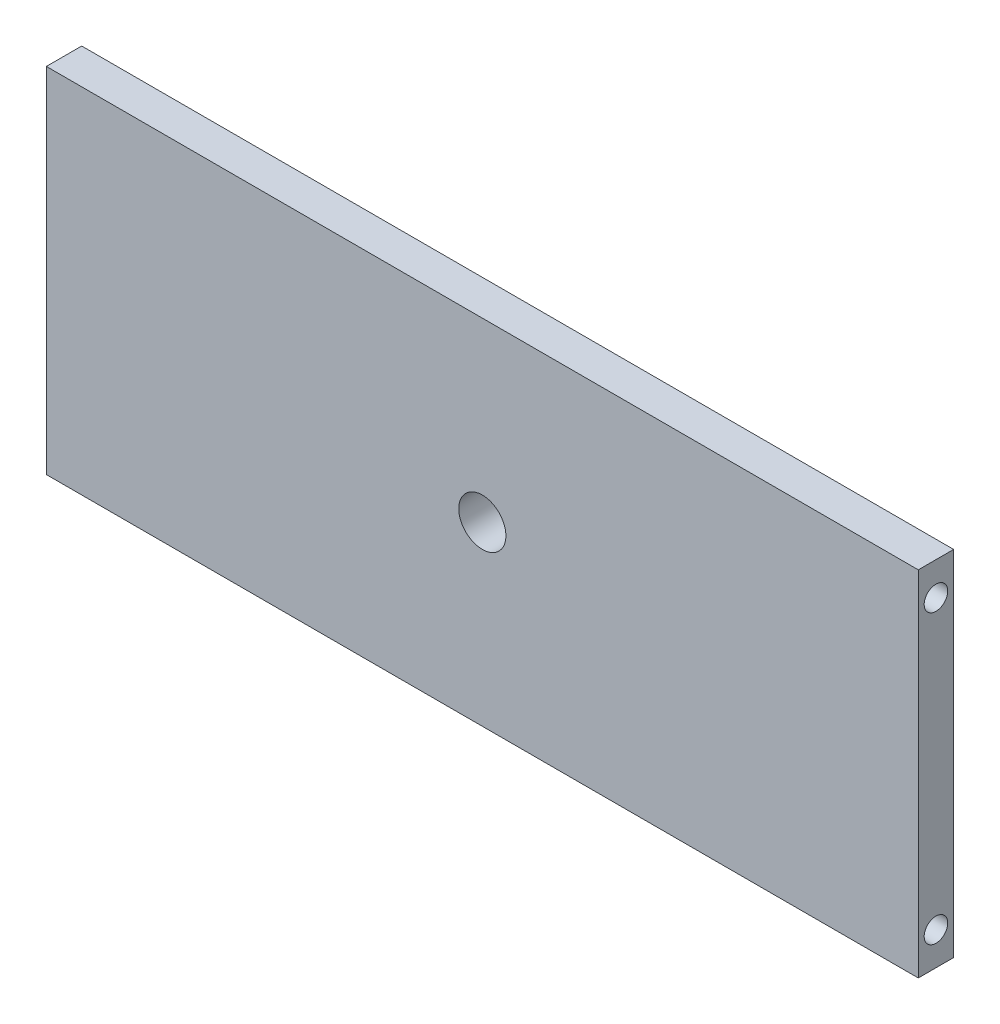
ISO-10303-21;
HEADER;
FILE_DESCRIPTION(('STEP AP214'),'2;1');
FILE_NAME('part.step','',(''),(''),'','','');
FILE_SCHEMA(('AUTOMOTIVE_DESIGN { 1 0 10303 214 1 1 1 1 }'));
ENDSEC;
DATA;
#1=APPLICATION_CONTEXT('core data for automotive mechanical design processes');
#2=APPLICATION_PROTOCOL_DEFINITION('international standard','automotive_design',2000,#1);
#3=PRODUCT_CONTEXT('',#1,'mechanical');
#4=PRODUCT('Part','Part','',(#3));
#5=PRODUCT_RELATED_PRODUCT_CATEGORY('part','',(#4));
#6=PRODUCT_DEFINITION_FORMATION('','',#4);
#7=PRODUCT_DEFINITION_CONTEXT('part definition',#1,'design');
#8=PRODUCT_DEFINITION('design','',#6,#7);
#9=PRODUCT_DEFINITION_SHAPE('','',#8);
#10=(LENGTH_UNIT() NAMED_UNIT(*) SI_UNIT(.MILLI.,.METRE.));
#11=(NAMED_UNIT(*) PLANE_ANGLE_UNIT() SI_UNIT($,.RADIAN.));
#12=(NAMED_UNIT(*) SI_UNIT($,.STERADIAN.) SOLID_ANGLE_UNIT());
#13=UNCERTAINTY_MEASURE_WITH_UNIT(LENGTH_MEASURE(1.E-05),#10,'distance_accuracy_value','');
#14=(GEOMETRIC_REPRESENTATION_CONTEXT(3) GLOBAL_UNCERTAINTY_ASSIGNED_CONTEXT((#13)) GLOBAL_UNIT_ASSIGNED_CONTEXT((#10,
#11,#12)) REPRESENTATION_CONTEXT('',''));
#15=CARTESIAN_POINT('',(0.,0.,0.));
#16=DIRECTION('',(0.,0.,1.));
#17=DIRECTION('',(1.,0.,0.));
#18=AXIS2_PLACEMENT_3D('',#15,#16,#17);
#19=CARTESIAN_POINT('',(185.,75.,15.));
#20=DIRECTION('',(-1.,0.,0.));
#21=DIRECTION('',(0.,0.,1.));
#22=AXIS2_PLACEMENT_3D('',#19,#20,#21);
#23=PLANE('',#22);
#24=CARTESIAN_POINT('',(185.,-61.0000000000001,7.49999999999998));
#25=DIRECTION('',(1.,0.,0.));
#26=DIRECTION('',(0.,1.,0.));
#27=AXIS2_PLACEMENT_3D('',#24,#25,#26);
#28=CIRCLE('',#27,5.);
#29=CARTESIAN_POINT('',(185.,-56.0000000000001,7.49999999999998));
#30=VERTEX_POINT('',#29);
#31=EDGE_CURVE('E127',#30,#30,#28,.T.);
#32=ORIENTED_EDGE('',*,*,#31,.F.);
#33=EDGE_LOOP('',(#32));
#34=FACE_BOUND('',#33,.T.);
#35=CARTESIAN_POINT('',(185.,60.9999999999999,7.5));
#36=DIRECTION('',(1.,0.,0.));
#37=DIRECTION('',(0.,1.,0.));
#38=AXIS2_PLACEMENT_3D('',#35,#36,#37);
#39=CIRCLE('',#38,5.00000000000001);
#40=CARTESIAN_POINT('',(185.,65.9999999999999,7.5));
#41=VERTEX_POINT('',#40);
#42=EDGE_CURVE('E121',#41,#41,#39,.T.);
#43=ORIENTED_EDGE('',*,*,#42,.F.);
#44=EDGE_LOOP('',(#43));
#45=FACE_BOUND('',#44,.T.);
#46=DIRECTION('',(0.,1.,0.));
#47=VECTOR('',#46,1.);
#48=CARTESIAN_POINT('',(185.,75.,0.));
#49=LINE('',#48,#47);
#50=CARTESIAN_POINT('',(185.,-75.,0.));
#51=VERTEX_POINT('',#50);
#52=CARTESIAN_POINT('',(185.,75.,0.));
#53=VERTEX_POINT('',#52);
#54=EDGE_CURVE('E95',#51,#53,#49,.T.);
#55=ORIENTED_EDGE('',*,*,#54,.T.);
#56=DIRECTION('',(0.,0.,-1.));
#57=VECTOR('',#56,1.);
#58=CARTESIAN_POINT('',(185.,75.,15.));
#59=LINE('',#58,#57);
#60=CARTESIAN_POINT('',(185.,75.,15.));
#61=VERTEX_POINT('',#60);
#62=EDGE_CURVE('E11',#61,#53,#59,.T.);
#63=ORIENTED_EDGE('',*,*,#62,.F.);
#64=DIRECTION('',(0.,1.,0.));
#65=VECTOR('',#64,1.);
#66=CARTESIAN_POINT('',(185.,75.,15.));
#67=LINE('',#66,#65);
#68=CARTESIAN_POINT('',(185.,-75.,15.));
#69=VERTEX_POINT('',#68);
#70=EDGE_CURVE('E83',#69,#61,#67,.T.);
#71=ORIENTED_EDGE('',*,*,#70,.F.);
#72=DIRECTION('',(0.,0.,-1.));
#73=VECTOR('',#72,1.);
#74=CARTESIAN_POINT('',(185.,-75.,15.));
#75=LINE('',#74,#73);
#76=EDGE_CURVE('E91',#69,#51,#75,.T.);
#77=ORIENTED_EDGE('',*,*,#76,.T.);
#78=EDGE_LOOP('',(#55,#63,#71,#77));
#79=FACE_BOUND('',#78,.T.);
#80=ADVANCED_FACE('F32',(#34,#45,#79),#23,.F.);
#81=CARTESIAN_POINT('',(-185.,75.,15.));
#82=DIRECTION('',(0.,-1.,0.));
#83=DIRECTION('',(0.,0.,-1.));
#84=AXIS2_PLACEMENT_3D('',#81,#82,#83);
#85=PLANE('',#84);
#86=DIRECTION('',(-1.,0.,0.));
#87=VECTOR('',#86,1.);
#88=CARTESIAN_POINT('',(-185.,75.,0.));
#89=LINE('',#88,#87);
#90=CARTESIAN_POINT('',(-185.,75.,0.));
#91=VERTEX_POINT('',#90);
#92=EDGE_CURVE('E87',#53,#91,#89,.T.);
#93=ORIENTED_EDGE('',*,*,#92,.T.);
#94=DIRECTION('',(0.,0.,-1.));
#95=VECTOR('',#94,1.);
#96=CARTESIAN_POINT('',(-185.,75.,15.));
#97=LINE('',#96,#95);
#98=CARTESIAN_POINT('',(-185.,75.,15.));
#99=VERTEX_POINT('',#98);
#100=EDGE_CURVE('E40',#99,#91,#97,.T.);
#101=ORIENTED_EDGE('',*,*,#100,.F.);
#102=DIRECTION('',(-1.,0.,0.));
#103=VECTOR('',#102,1.);
#104=CARTESIAN_POINT('',(-185.,75.,15.));
#105=LINE('',#104,#103);
#106=EDGE_CURVE('E78',#61,#99,#105,.T.);
#107=ORIENTED_EDGE('',*,*,#106,.F.);
#108=ORIENTED_EDGE('',*,*,#62,.T.);
#109=EDGE_LOOP('',(#93,#101,#107,#108));
#110=FACE_BOUND('',#109,.T.);
#111=ADVANCED_FACE('F86',(#110),#85,.F.);
#112=CARTESIAN_POINT('',(-185.,75.,15.));
#113=DIRECTION('',(1.,0.,0.));
#114=DIRECTION('',(0.,1.,0.));
#115=AXIS2_PLACEMENT_3D('',#112,#113,#114);
#116=PLANE('',#115);
#117=CARTESIAN_POINT('',(-185.,-61.,7.50000000000002));
#118=DIRECTION('',(-1.,0.,0.));
#119=DIRECTION('',(0.,-1.,0.));
#120=AXIS2_PLACEMENT_3D('',#117,#118,#119);
#121=CIRCLE('',#120,5.);
#122=CARTESIAN_POINT('',(-185.,-66.,7.50000000000002));
#123=VERTEX_POINT('',#122);
#124=EDGE_CURVE('E115',#123,#123,#121,.T.);
#125=ORIENTED_EDGE('',*,*,#124,.F.);
#126=EDGE_LOOP('',(#125));
#127=FACE_BOUND('',#126,.T.);
#128=CARTESIAN_POINT('',(-185.,61.,7.5));
#129=DIRECTION('',(-1.,0.,0.));
#130=DIRECTION('',(0.,-1.,0.));
#131=AXIS2_PLACEMENT_3D('',#128,#129,#130);
#132=CIRCLE('',#131,4.99999999999999);
#133=CARTESIAN_POINT('',(-185.,56.,7.5));
#134=VERTEX_POINT('',#133);
#135=EDGE_CURVE('E109',#134,#134,#132,.T.);
#136=ORIENTED_EDGE('',*,*,#135,.F.);
#137=EDGE_LOOP('',(#136));
#138=FACE_BOUND('',#137,.T.);
#139=DIRECTION('',(0.,-1.,0.));
#140=VECTOR('',#139,1.);
#141=CARTESIAN_POINT('',(-185.,75.,0.));
#142=LINE('',#141,#140);
#143=CARTESIAN_POINT('',(-185.,-75.,0.));
#144=VERTEX_POINT('',#143);
#145=EDGE_CURVE('E65',#91,#144,#142,.T.);
#146=ORIENTED_EDGE('',*,*,#145,.T.);
#147=DIRECTION('',(0.,0.,-1.));
#148=VECTOR('',#147,1.);
#149=CARTESIAN_POINT('',(-185.,-75.,15.));
#150=LINE('',#149,#148);
#151=CARTESIAN_POINT('',(-185.,-75.,15.));
#152=VERTEX_POINT('',#151);
#153=EDGE_CURVE('E88',#152,#144,#150,.T.);
#154=ORIENTED_EDGE('',*,*,#153,.F.);
#155=DIRECTION('',(0.,-1.,0.));
#156=VECTOR('',#155,1.);
#157=CARTESIAN_POINT('',(-185.,75.,15.));
#158=LINE('',#157,#156);
#159=EDGE_CURVE('E81',#99,#152,#158,.T.);
#160=ORIENTED_EDGE('',*,*,#159,.F.);
#161=ORIENTED_EDGE('',*,*,#100,.T.);
#162=EDGE_LOOP('',(#146,#154,#160,#161));
#163=FACE_BOUND('',#162,.T.);
#164=ADVANCED_FACE('F89',(#127,#138,#163),#116,.F.);
#165=CARTESIAN_POINT('',(-185.,-75.,15.));
#166=DIRECTION('',(0.,1.,0.));
#167=DIRECTION('',(0.,0.,1.));
#168=AXIS2_PLACEMENT_3D('',#165,#166,#167);
#169=PLANE('',#168);
#170=DIRECTION('',(1.,0.,0.));
#171=VECTOR('',#170,1.);
#172=CARTESIAN_POINT('',(-185.,-75.,0.));
#173=LINE('',#172,#171);
#174=EDGE_CURVE('E71',#144,#51,#173,.T.);
#175=ORIENTED_EDGE('',*,*,#174,.T.);
#176=ORIENTED_EDGE('',*,*,#76,.F.);
#177=DIRECTION('',(1.,0.,0.));
#178=VECTOR('',#177,1.);
#179=CARTESIAN_POINT('',(-185.,-75.,15.));
#180=LINE('',#179,#178);
#181=EDGE_CURVE('E48',#152,#69,#180,.T.);
#182=ORIENTED_EDGE('',*,*,#181,.F.);
#183=ORIENTED_EDGE('',*,*,#153,.T.);
#184=EDGE_LOOP('',(#175,#176,#182,#183));
#185=FACE_BOUND('',#184,.T.);
#186=ADVANCED_FACE('F103',(#185),#169,.F.);
#187=CARTESIAN_POINT('',(0.,0.,15.));
#188=DIRECTION('',(0.,0.,1.));
#189=DIRECTION('',(1.,0.,0.));
#190=AXIS2_PLACEMENT_3D('',#187,#188,#189);
#191=PLANE('',#190);
#192=CARTESIAN_POINT('',(0.,0.,15.));
#193=DIRECTION('',(0.,0.,1.));
#194=DIRECTION('',(1.,0.,0.));
#195=AXIS2_PLACEMENT_3D('',#192,#193,#194);
#196=CIRCLE('',#195,10.);
#197=CARTESIAN_POINT('',(10.,0.,15.));
#198=VERTEX_POINT('',#197);
#199=EDGE_CURVE('E133',#198,#198,#196,.T.);
#200=ORIENTED_EDGE('',*,*,#199,.F.);
#201=EDGE_LOOP('',(#200));
#202=FACE_BOUND('',#201,.T.);
#203=ORIENTED_EDGE('',*,*,#70,.T.);
#204=ORIENTED_EDGE('',*,*,#106,.T.);
#205=ORIENTED_EDGE('',*,*,#159,.T.);
#206=ORIENTED_EDGE('',*,*,#181,.T.);
#207=EDGE_LOOP('',(#203,#204,#205,#206));
#208=FACE_BOUND('',#207,.T.);
#209=ADVANCED_FACE('F79',(#202,#208),#191,.T.);
#210=CARTESIAN_POINT('',(0.,0.,0.));
#211=DIRECTION('',(0.,0.,1.));
#212=DIRECTION('',(1.,0.,0.));
#213=AXIS2_PLACEMENT_3D('',#210,#211,#212);
#214=PLANE('',#213);
#215=CARTESIAN_POINT('',(0.,0.,0.));
#216=DIRECTION('',(0.,0.,1.));
#217=DIRECTION('',(1.,0.,0.));
#218=AXIS2_PLACEMENT_3D('',#215,#216,#217);
#219=CIRCLE('',#218,10.);
#220=CARTESIAN_POINT('',(10.,0.,0.));
#221=VERTEX_POINT('',#220);
#222=EDGE_CURVE('E130',#221,#221,#219,.T.);
#223=ORIENTED_EDGE('',*,*,#222,.T.);
#224=EDGE_LOOP('',(#223));
#225=FACE_BOUND('',#224,.T.);
#226=ORIENTED_EDGE('',*,*,#54,.F.);
#227=ORIENTED_EDGE('',*,*,#174,.F.);
#228=ORIENTED_EDGE('',*,*,#145,.F.);
#229=ORIENTED_EDGE('',*,*,#92,.F.);
#230=EDGE_LOOP('',(#226,#227,#228,#229));
#231=FACE_BOUND('',#230,.T.);
#232=ADVANCED_FACE('F106',(#225,#231),#214,.F.);
#233=CARTESIAN_POINT('',(-155.,61.,7.5));
#234=DIRECTION('',(-1.,0.,0.));
#235=DIRECTION('',(0.,-1.,0.));
#236=AXIS2_PLACEMENT_3D('',#233,#234,#235);
#237=CYLINDRICAL_SURFACE('',#236,4.99999999999999);
#238=CARTESIAN_POINT('',(-155.,61.,7.5));
#239=DIRECTION('',(-1.,0.,0.));
#240=DIRECTION('',(0.,-1.,0.));
#241=AXIS2_PLACEMENT_3D('',#238,#239,#240);
#242=CIRCLE('',#241,4.99999999999999);
#243=CARTESIAN_POINT('',(-155.,56.,7.5));
#244=VERTEX_POINT('',#243);
#245=EDGE_CURVE('E98',#244,#244,#242,.T.);
#246=ORIENTED_EDGE('',*,*,#245,.F.);
#247=EDGE_LOOP('',(#246));
#248=FACE_BOUND('',#247,.T.);
#249=ORIENTED_EDGE('',*,*,#135,.T.);
#250=EDGE_LOOP('',(#249));
#251=FACE_BOUND('',#250,.T.);
#252=ADVANCED_FACE('F153',(#248,#251),#237,.F.);
#253=CARTESIAN_POINT('',(-155.,61.,7.5));
#254=DIRECTION('',(-1.,0.,0.));
#255=DIRECTION('',(0.,-1.,0.));
#256=AXIS2_PLACEMENT_3D('',#253,#254,#255);
#257=PLANE('',#256);
#258=ORIENTED_EDGE('',*,*,#245,.T.);
#259=EDGE_LOOP('',(#258));
#260=FACE_BOUND('',#259,.T.);
#261=ADVANCED_FACE('F187',(#260),#257,.T.);
#262=CARTESIAN_POINT('',(-155.,-61.,7.50000000000002));
#263=DIRECTION('',(-1.,0.,0.));
#264=DIRECTION('',(0.,-1.,0.));
#265=AXIS2_PLACEMENT_3D('',#262,#263,#264);
#266=CYLINDRICAL_SURFACE('',#265,5.);
#267=CARTESIAN_POINT('',(-155.,-61.,7.50000000000002));
#268=DIRECTION('',(-1.,0.,0.));
#269=DIRECTION('',(0.,-1.,0.));
#270=AXIS2_PLACEMENT_3D('',#267,#268,#269);
#271=CIRCLE('',#270,5.);
#272=CARTESIAN_POINT('',(-155.,-66.,7.50000000000002));
#273=VERTEX_POINT('',#272);
#274=EDGE_CURVE('E112',#273,#273,#271,.T.);
#275=ORIENTED_EDGE('',*,*,#274,.F.);
#276=EDGE_LOOP('',(#275));
#277=FACE_BOUND('',#276,.T.);
#278=ORIENTED_EDGE('',*,*,#124,.T.);
#279=EDGE_LOOP('',(#278));
#280=FACE_BOUND('',#279,.T.);
#281=ADVANCED_FACE('F179',(#277,#280),#266,.F.);
#282=CARTESIAN_POINT('',(-155.,-61.,7.50000000000002));
#283=DIRECTION('',(-1.,0.,0.));
#284=DIRECTION('',(0.,-1.,0.));
#285=AXIS2_PLACEMENT_3D('',#282,#283,#284);
#286=PLANE('',#285);
#287=ORIENTED_EDGE('',*,*,#274,.T.);
#288=EDGE_LOOP('',(#287));
#289=FACE_BOUND('',#288,.T.);
#290=ADVANCED_FACE('F169',(#289),#286,.T.);
#291=CARTESIAN_POINT('',(155.,60.9999999999999,7.5));
#292=DIRECTION('',(1.,0.,0.));
#293=DIRECTION('',(0.,1.,0.));
#294=AXIS2_PLACEMENT_3D('',#291,#292,#293);
#295=CYLINDRICAL_SURFACE('',#294,5.00000000000001);
#296=CARTESIAN_POINT('',(155.,60.9999999999999,7.5));
#297=DIRECTION('',(1.,0.,0.));
#298=DIRECTION('',(0.,1.,0.));
#299=AXIS2_PLACEMENT_3D('',#296,#297,#298);
#300=CIRCLE('',#299,5.00000000000001);
#301=CARTESIAN_POINT('',(155.,65.9999999999999,7.5));
#302=VERTEX_POINT('',#301);
#303=EDGE_CURVE('E118',#302,#302,#300,.T.);
#304=ORIENTED_EDGE('',*,*,#303,.F.);
#305=EDGE_LOOP('',(#304));
#306=FACE_BOUND('',#305,.T.);
#307=ORIENTED_EDGE('',*,*,#42,.T.);
#308=EDGE_LOOP('',(#307));
#309=FACE_BOUND('',#308,.T.);
#310=ADVANCED_FACE('F166',(#306,#309),#295,.F.);
#311=CARTESIAN_POINT('',(155.,60.9999999999999,7.5));
#312=DIRECTION('',(1.,0.,0.));
#313=DIRECTION('',(0.,1.,0.));
#314=AXIS2_PLACEMENT_3D('',#311,#312,#313);
#315=PLANE('',#314);
#316=ORIENTED_EDGE('',*,*,#303,.T.);
#317=EDGE_LOOP('',(#316));
#318=FACE_BOUND('',#317,.T.);
#319=ADVANCED_FACE('F168',(#318),#315,.T.);
#320=CARTESIAN_POINT('',(155.,-61.0000000000001,7.49999999999998));
#321=DIRECTION('',(1.,0.,0.));
#322=DIRECTION('',(0.,1.,0.));
#323=AXIS2_PLACEMENT_3D('',#320,#321,#322);
#324=CYLINDRICAL_SURFACE('',#323,5.);
#325=CARTESIAN_POINT('',(155.,-61.0000000000001,7.49999999999998));
#326=DIRECTION('',(1.,0.,0.));
#327=DIRECTION('',(0.,1.,0.));
#328=AXIS2_PLACEMENT_3D('',#325,#326,#327);
#329=CIRCLE('',#328,5.);
#330=CARTESIAN_POINT('',(155.,-56.0000000000001,7.49999999999998));
#331=VERTEX_POINT('',#330);
#332=EDGE_CURVE('E124',#331,#331,#329,.T.);
#333=ORIENTED_EDGE('',*,*,#332,.F.);
#334=EDGE_LOOP('',(#333));
#335=FACE_BOUND('',#334,.T.);
#336=ORIENTED_EDGE('',*,*,#31,.T.);
#337=EDGE_LOOP('',(#336));
#338=FACE_BOUND('',#337,.T.);
#339=ADVANCED_FACE('F176',(#335,#338),#324,.F.);
#340=CARTESIAN_POINT('',(155.,-61.0000000000001,7.49999999999998));
#341=DIRECTION('',(1.,0.,0.));
#342=DIRECTION('',(0.,1.,0.));
#343=AXIS2_PLACEMENT_3D('',#340,#341,#342);
#344=PLANE('',#343);
#345=ORIENTED_EDGE('',*,*,#332,.T.);
#346=EDGE_LOOP('',(#345));
#347=FACE_BOUND('',#346,.T.);
#348=ADVANCED_FACE('F143',(#347),#344,.T.);
#349=CARTESIAN_POINT('',(0.,0.,0.));
#350=DIRECTION('',(0.,0.,1.));
#351=DIRECTION('',(1.,0.,0.));
#352=AXIS2_PLACEMENT_3D('',#349,#350,#351);
#353=CYLINDRICAL_SURFACE('',#352,10.);
#354=ORIENTED_EDGE('',*,*,#222,.F.);
#355=EDGE_LOOP('',(#354));
#356=FACE_BOUND('',#355,.T.);
#357=ORIENTED_EDGE('',*,*,#199,.T.);
#358=EDGE_LOOP('',(#357));
#359=FACE_BOUND('',#358,.T.);
#360=ADVANCED_FACE('F140',(#356,#359),#353,.F.);
#361=CLOSED_SHELL('',(#80,#111,#164,#186,#209,#232,#252,#261,#281,#290,#310,#319,#339,#348,#360));
#362=MANIFOLD_SOLID_BREP('B2',#361);
#363=ADVANCED_BREP_SHAPE_REPRESENTATION('',(#18,#362),#14);
#364=SHAPE_DEFINITION_REPRESENTATION(#9,#363);
ENDSEC;
END-ISO-10303-21;
